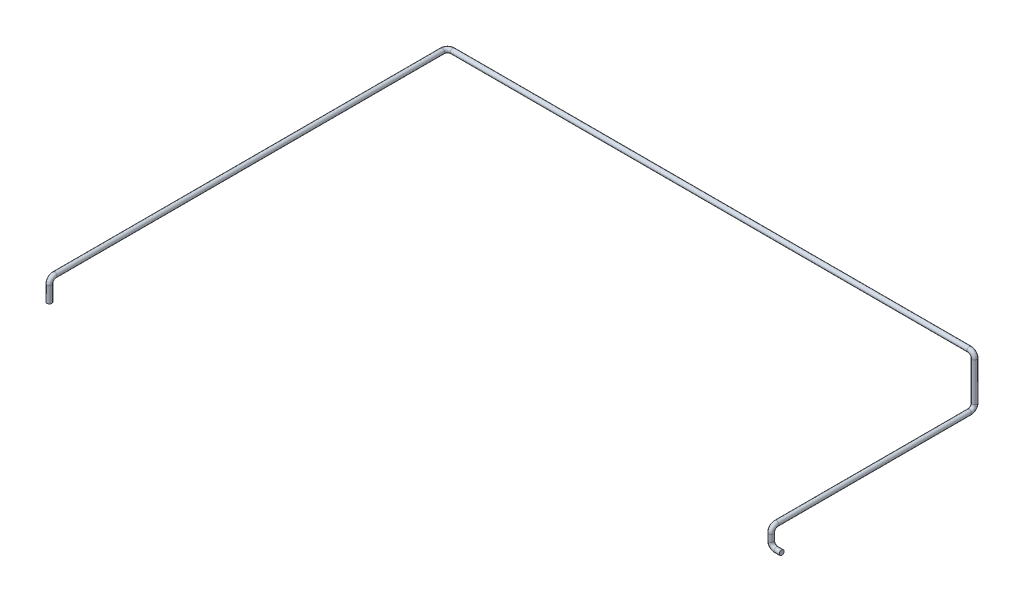
ISO-10303-21;
HEADER;
FILE_DESCRIPTION(('STEP AP214'),'2;1');
FILE_NAME('part.step','',(''),(''),'','','');
FILE_SCHEMA(('AUTOMOTIVE_DESIGN { 1 0 10303 214 1 1 1 1 }'));
ENDSEC;
DATA;
#1=APPLICATION_CONTEXT('core data for automotive mechanical design processes');
#2=APPLICATION_PROTOCOL_DEFINITION('international standard','automotive_design',2000,#1);
#3=PRODUCT_CONTEXT('',#1,'mechanical');
#4=PRODUCT('Part','Part','',(#3));
#5=PRODUCT_RELATED_PRODUCT_CATEGORY('part','',(#4));
#6=PRODUCT_DEFINITION_FORMATION('','',#4);
#7=PRODUCT_DEFINITION_CONTEXT('part definition',#1,'design');
#8=PRODUCT_DEFINITION('design','',#6,#7);
#9=PRODUCT_DEFINITION_SHAPE('','',#8);
#10=(LENGTH_UNIT() NAMED_UNIT(*) SI_UNIT(.MILLI.,.METRE.));
#11=(NAMED_UNIT(*) PLANE_ANGLE_UNIT() SI_UNIT($,.RADIAN.));
#12=(NAMED_UNIT(*) SI_UNIT($,.STERADIAN.) SOLID_ANGLE_UNIT());
#13=UNCERTAINTY_MEASURE_WITH_UNIT(LENGTH_MEASURE(1.E-05),#10,'distance_accuracy_value','');
#14=(GEOMETRIC_REPRESENTATION_CONTEXT(3) GLOBAL_UNCERTAINTY_ASSIGNED_CONTEXT((#13)) GLOBAL_UNIT_ASSIGNED_CONTEXT((#10,
#11,#12)) REPRESENTATION_CONTEXT('',''));
#15=CARTESIAN_POINT('',(0.,0.,0.));
#16=DIRECTION('',(0.,0.,1.));
#17=DIRECTION('',(1.,0.,0.));
#18=AXIS2_PLACEMENT_3D('',#15,#16,#17);
#19=CARTESIAN_POINT('',(0.,0.,0.));
#20=DIRECTION('',(1.,0.,0.));
#21=DIRECTION('',(0.,0.,-1.));
#22=AXIS2_PLACEMENT_3D('',#19,#20,#21);
#23=PLANE('',#22);
#24=CARTESIAN_POINT('',(0.,0.,0.));
#25=DIRECTION('',(1.,0.,0.));
#26=DIRECTION('',(0.,0.,-1.));
#27=AXIS2_PLACEMENT_3D('',#24,#25,#26);
#28=CIRCLE('',#27,13.7);
#29=CARTESIAN_POINT('',(0.,0.,-13.7));
#30=VERTEX_POINT('',#29);
#31=EDGE_CURVE('E47',#30,#30,#28,.T.);
#32=ORIENTED_EDGE('',*,*,#31,.T.);
#33=EDGE_LOOP('',(#32));
#34=FACE_BOUND('',#33,.T.);
#35=ADVANCED_FACE('F35',(#34),#23,.T.);
#36=CARTESIAN_POINT('',(-3065.,260.,1110.));
#37=DIRECTION('',(0.,1.,0.));
#38=DIRECTION('',(-1.,0.,0.));
#39=AXIS2_PLACEMENT_3D('',#36,#37,#38);
#40=PLANE('',#39);
#41=CARTESIAN_POINT('',(-3065.,260.,1110.));
#42=DIRECTION('',(0.,1.,0.));
#43=DIRECTION('',(-1.,0.,0.));
#44=AXIS2_PLACEMENT_3D('',#41,#42,#43);
#45=CIRCLE('',#44,13.7);
#46=CARTESIAN_POINT('',(-3078.7,260.,1110.));
#47=VERTEX_POINT('',#46);
#48=EDGE_CURVE('E11',#47,#47,#45,.T.);
#49=ORIENTED_EDGE('',*,*,#48,.F.);
#50=EDGE_LOOP('',(#49));
#51=FACE_BOUND('',#50,.T.);
#52=ADVANCED_FACE('F53',(#51),#40,.F.);
#53=CARTESIAN_POINT('',(0.,0.,0.));
#54=DIRECTION('',(-1.,0.,0.));
#55=DIRECTION('',(0.,0.,1.));
#56=AXIS2_PLACEMENT_3D('',#53,#54,#55);
#57=CYLINDRICAL_SURFACE('',#56,13.7);
#58=CARTESIAN_POINT('',(-30.,0.,0.));
#59=DIRECTION('',(1.,0.,0.));
#60=DIRECTION('',(0.,0.,-1.));
#61=AXIS2_PLACEMENT_3D('',#58,#59,#60);
#62=CIRCLE('',#61,13.7);
#63=CARTESIAN_POINT('',(-30.,-13.7,0.));
#64=VERTEX_POINT('',#63);
#65=EDGE_CURVE('E119',#64,#64,#62,.T.);
#66=ORIENTED_EDGE('',*,*,#65,.T.);
#67=EDGE_LOOP('',(#66));
#68=FACE_BOUND('',#67,.T.);
#69=ORIENTED_EDGE('',*,*,#31,.F.);
#70=EDGE_LOOP('',(#69));
#71=FACE_BOUND('',#70,.T.);
#72=ADVANCED_FACE('F55',(#68,#71),#57,.T.);
#73=CARTESIAN_POINT('',(-30.,30.,0.));
#74=DIRECTION('',(0.,0.,-1.));
#75=DIRECTION('',(-1.,0.,0.));
#76=AXIS2_PLACEMENT_3D('',#73,#74,#75);
#77=TOROIDAL_SURFACE('',#76,30.,13.7);
#78=CARTESIAN_POINT('',(-60.,30.,0.));
#79=DIRECTION('',(0.,-1.,0.));
#80=DIRECTION('',(0.,0.,-1.));
#81=AXIS2_PLACEMENT_3D('',#78,#79,#80);
#82=CIRCLE('',#81,13.7);
#83=CARTESIAN_POINT('',(-73.7,30.,0.));
#84=VERTEX_POINT('',#83);
#85=EDGE_CURVE('E116',#84,#84,#82,.T.);
#86=CARTESIAN_POINT('',(-30.,30.,0.));
#87=DIRECTION('',(0.,0.,-1.));
#88=DIRECTION('',(-1.,0.,0.));
#89=AXIS2_PLACEMENT_3D('',#86,#87,#88);
#90=CIRCLE('',#89,43.7);
#91=EDGE_CURVE('',#64,#84,#90,.T.);
#92=ORIENTED_EDGE('',*,*,#65,.F.);
#93=ORIENTED_EDGE('',*,*,#85,.T.);
#94=ORIENTED_EDGE('',*,*,#91,.T.);
#95=ORIENTED_EDGE('',*,*,#91,.F.);
#96=EDGE_LOOP('',(#92,#94,#93,#95));
#97=FACE_BOUND('',#96,.T.);
#98=ADVANCED_FACE('F60',(#97),#77,.T.);
#99=CARTESIAN_POINT('',(-60.,30.,0.));
#100=DIRECTION('',(0.,1.,0.));
#101=DIRECTION('',(0.,0.,1.));
#102=AXIS2_PLACEMENT_3D('',#99,#100,#101);
#103=CYLINDRICAL_SURFACE('',#102,13.7);
#104=CARTESIAN_POINT('',(-60.,70.,0.));
#105=DIRECTION('',(0.,-1.,0.));
#106=DIRECTION('',(0.,0.,-1.));
#107=AXIS2_PLACEMENT_3D('',#104,#105,#106);
#108=CIRCLE('',#107,13.7);
#109=CARTESIAN_POINT('',(-60.,70.,13.7));
#110=VERTEX_POINT('',#109);
#111=EDGE_CURVE('E121',#110,#110,#108,.T.);
#112=ORIENTED_EDGE('',*,*,#111,.T.);
#113=EDGE_LOOP('',(#112));
#114=FACE_BOUND('',#113,.T.);
#115=ORIENTED_EDGE('',*,*,#85,.F.);
#116=EDGE_LOOP('',(#115));
#117=FACE_BOUND('',#116,.T.);
#118=ADVANCED_FACE('F104',(#114,#117),#103,.T.);
#119=CARTESIAN_POINT('',(-60.,70.,-30.));
#120=DIRECTION('',(-1.,0.,0.));
#121=DIRECTION('',(0.,0.,1.));
#122=AXIS2_PLACEMENT_3D('',#119,#120,#121);
#123=TOROIDAL_SURFACE('',#122,30.,13.7);
#124=CARTESIAN_POINT('',(-60.,100.,-30.));
#125=DIRECTION('',(0.,0.,1.));
#126=DIRECTION('',(0.,-1.,0.));
#127=AXIS2_PLACEMENT_3D('',#124,#125,#126);
#128=CIRCLE('',#127,13.7);
#129=CARTESIAN_POINT('',(-60.,113.7,-30.));
#130=VERTEX_POINT('',#129);
#131=EDGE_CURVE('E127',#130,#130,#128,.T.);
#132=CARTESIAN_POINT('',(-60.,70.,-30.));
#133=DIRECTION('',(-1.,0.,0.));
#134=DIRECTION('',(0.,0.,1.));
#135=AXIS2_PLACEMENT_3D('',#132,#133,#134);
#136=CIRCLE('',#135,43.7);
#137=EDGE_CURVE('',#110,#130,#136,.T.);
#138=ORIENTED_EDGE('',*,*,#111,.F.);
#139=ORIENTED_EDGE('',*,*,#131,.T.);
#140=ORIENTED_EDGE('',*,*,#137,.T.);
#141=ORIENTED_EDGE('',*,*,#137,.F.);
#142=EDGE_LOOP('',(#138,#140,#139,#141));
#143=FACE_BOUND('',#142,.T.);
#144=ADVANCED_FACE('F100',(#143),#123,.T.);
#145=CARTESIAN_POINT('',(-60.,100.,-30.));
#146=DIRECTION('',(0.,0.,-1.));
#147=DIRECTION('',(-1.,0.,0.));
#148=AXIS2_PLACEMENT_3D('',#145,#146,#147);
#149=CYLINDRICAL_SURFACE('',#148,13.7);
#150=CARTESIAN_POINT('',(-60.0000000000001,100.,-1130.));
#151=DIRECTION('',(0.,0.,1.));
#152=DIRECTION('',(0.,-1.,0.));
#153=AXIS2_PLACEMENT_3D('',#150,#151,#152);
#154=CIRCLE('',#153,13.7);
#155=CARTESIAN_POINT('',(-60.0000000000001,86.3,-1130.));
#156=VERTEX_POINT('',#155);
#157=EDGE_CURVE('E130',#156,#156,#154,.T.);
#158=ORIENTED_EDGE('',*,*,#157,.T.);
#159=EDGE_LOOP('',(#158));
#160=FACE_BOUND('',#159,.T.);
#161=ORIENTED_EDGE('',*,*,#131,.F.);
#162=EDGE_LOOP('',(#161));
#163=FACE_BOUND('',#162,.T.);
#164=ADVANCED_FACE('F96',(#160,#163),#149,.T.);
#165=CARTESIAN_POINT('',(-60.,130.,-1130.));
#166=DIRECTION('',(1.,0.,0.));
#167=DIRECTION('',(0.,0.,-1.));
#168=AXIS2_PLACEMENT_3D('',#165,#166,#167);
#169=TOROIDAL_SURFACE('',#168,30.,13.7);
#170=CARTESIAN_POINT('',(-60.,130.,-1160.));
#171=DIRECTION('',(0.,-1.,0.));
#172=DIRECTION('',(0.,0.,-1.));
#173=AXIS2_PLACEMENT_3D('',#170,#171,#172);
#174=CIRCLE('',#173,13.7);
#175=CARTESIAN_POINT('',(-60.,130.,-1173.7));
#176=VERTEX_POINT('',#175);
#177=EDGE_CURVE('E133',#176,#176,#174,.T.);
#178=CARTESIAN_POINT('',(-60.,130.,-1130.));
#179=DIRECTION('',(1.,0.,0.));
#180=DIRECTION('',(0.,0.,-1.));
#181=AXIS2_PLACEMENT_3D('',#178,#179,#180);
#182=CIRCLE('',#181,43.7);
#183=EDGE_CURVE('',#156,#176,#182,.T.);
#184=ORIENTED_EDGE('',*,*,#157,.F.);
#185=ORIENTED_EDGE('',*,*,#177,.T.);
#186=ORIENTED_EDGE('',*,*,#183,.T.);
#187=ORIENTED_EDGE('',*,*,#183,.F.);
#188=EDGE_LOOP('',(#184,#186,#185,#187));
#189=FACE_BOUND('',#188,.T.);
#190=ADVANCED_FACE('F92',(#189),#169,.T.);
#191=CARTESIAN_POINT('',(-60.0000000000001,130.,-1160.));
#192=DIRECTION('',(0.,1.,0.));
#193=DIRECTION('',(-1.,0.,0.));
#194=AXIS2_PLACEMENT_3D('',#191,#192,#193);
#195=CYLINDRICAL_SURFACE('',#194,13.7);
#196=CARTESIAN_POINT('',(-60.0000000000001,350.,-1160.));
#197=DIRECTION('',(0.,-1.,0.));
#198=DIRECTION('',(0.,0.,-1.));
#199=AXIS2_PLACEMENT_3D('',#196,#197,#198);
#200=CIRCLE('',#199,13.7);
#201=CARTESIAN_POINT('',(-46.3,350.,-1160.));
#202=VERTEX_POINT('',#201);
#203=EDGE_CURVE('E136',#202,#202,#200,.T.);
#204=ORIENTED_EDGE('',*,*,#203,.T.);
#205=EDGE_LOOP('',(#204));
#206=FACE_BOUND('',#205,.T.);
#207=ORIENTED_EDGE('',*,*,#177,.F.);
#208=EDGE_LOOP('',(#207));
#209=FACE_BOUND('',#208,.T.);
#210=ADVANCED_FACE('F88',(#206,#209),#195,.T.);
#211=CARTESIAN_POINT('',(-90.0000000000001,350.,-1160.));
#212=DIRECTION('',(0.,0.,1.));
#213=DIRECTION('',(1.,0.,0.));
#214=AXIS2_PLACEMENT_3D('',#211,#212,#213);
#215=TOROIDAL_SURFACE('',#214,30.,13.7);
#216=CARTESIAN_POINT('',(-90.0000000000001,380.,-1160.));
#217=DIRECTION('',(1.,0.,0.));
#218=DIRECTION('',(0.,0.,-1.));
#219=AXIS2_PLACEMENT_3D('',#216,#217,#218);
#220=CIRCLE('',#219,13.7);
#221=CARTESIAN_POINT('',(-90.0000000000001,393.7,-1160.));
#222=VERTEX_POINT('',#221);
#223=EDGE_CURVE('E139',#222,#222,#220,.T.);
#224=CARTESIAN_POINT('',(-90.0000000000001,350.,-1160.));
#225=DIRECTION('',(0.,0.,1.));
#226=DIRECTION('',(1.,0.,0.));
#227=AXIS2_PLACEMENT_3D('',#224,#225,#226);
#228=CIRCLE('',#227,43.7);
#229=EDGE_CURVE('',#202,#222,#228,.T.);
#230=ORIENTED_EDGE('',*,*,#203,.F.);
#231=ORIENTED_EDGE('',*,*,#223,.T.);
#232=ORIENTED_EDGE('',*,*,#229,.T.);
#233=ORIENTED_EDGE('',*,*,#229,.F.);
#234=EDGE_LOOP('',(#230,#232,#231,#233));
#235=FACE_BOUND('',#234,.T.);
#236=ADVANCED_FACE('F84',(#235),#215,.T.);
#237=CARTESIAN_POINT('',(-90.0000000000001,380.,-1160.));
#238=DIRECTION('',(-1.,0.,0.));
#239=DIRECTION('',(0.,0.,1.));
#240=AXIS2_PLACEMENT_3D('',#237,#238,#239);
#241=CYLINDRICAL_SURFACE('',#240,13.7);
#242=CARTESIAN_POINT('',(-3035.,380.,-1160.));
#243=DIRECTION('',(1.,0.,0.));
#244=DIRECTION('',(0.,0.,-1.));
#245=AXIS2_PLACEMENT_3D('',#242,#243,#244);
#246=CIRCLE('',#245,13.7);
#247=CARTESIAN_POINT('',(-3035.,380.,-1173.7));
#248=VERTEX_POINT('',#247);
#249=EDGE_CURVE('E142',#248,#248,#246,.T.);
#250=ORIENTED_EDGE('',*,*,#249,.T.);
#251=EDGE_LOOP('',(#250));
#252=FACE_BOUND('',#251,.T.);
#253=ORIENTED_EDGE('',*,*,#223,.F.);
#254=EDGE_LOOP('',(#253));
#255=FACE_BOUND('',#254,.T.);
#256=ADVANCED_FACE('F80',(#252,#255),#241,.T.);
#257=CARTESIAN_POINT('',(-3035.,380.,-1130.));
#258=DIRECTION('',(0.,1.,0.));
#259=DIRECTION('',(0.,0.,1.));
#260=AXIS2_PLACEMENT_3D('',#257,#258,#259);
#261=TOROIDAL_SURFACE('',#260,29.9999999999998,13.7);
#262=CARTESIAN_POINT('',(-3065.,380.,-1130.));
#263=DIRECTION('',(0.,0.,-1.));
#264=DIRECTION('',(-1.,0.,0.));
#265=AXIS2_PLACEMENT_3D('',#262,#263,#264);
#266=CIRCLE('',#265,13.7);
#267=CARTESIAN_POINT('',(-3078.7,380.,-1130.));
#268=VERTEX_POINT('',#267);
#269=EDGE_CURVE('E145',#268,#268,#266,.T.);
#270=CARTESIAN_POINT('',(-3035.,380.,-1130.));
#271=DIRECTION('',(0.,1.,0.));
#272=DIRECTION('',(0.,0.,1.));
#273=AXIS2_PLACEMENT_3D('',#270,#271,#272);
#274=CIRCLE('',#273,43.6999999999998);
#275=EDGE_CURVE('',#248,#268,#274,.T.);
#276=ORIENTED_EDGE('',*,*,#249,.F.);
#277=ORIENTED_EDGE('',*,*,#269,.T.);
#278=ORIENTED_EDGE('',*,*,#275,.T.);
#279=ORIENTED_EDGE('',*,*,#275,.F.);
#280=EDGE_LOOP('',(#276,#278,#277,#279));
#281=FACE_BOUND('',#280,.T.);
#282=ADVANCED_FACE('F76',(#281),#261,.T.);
#283=CARTESIAN_POINT('',(-3065.,380.,-1130.));
#284=DIRECTION('',(0.,0.,1.));
#285=DIRECTION('',(1.,0.,0.));
#286=AXIS2_PLACEMENT_3D('',#283,#284,#285);
#287=CYLINDRICAL_SURFACE('',#286,13.7);
#288=CARTESIAN_POINT('',(-3065.,380.,1080.));
#289=DIRECTION('',(0.,0.,-1.));
#290=DIRECTION('',(-1.,0.,0.));
#291=AXIS2_PLACEMENT_3D('',#288,#289,#290);
#292=CIRCLE('',#291,13.7);
#293=CARTESIAN_POINT('',(-3065.,393.7,1080.));
#294=VERTEX_POINT('',#293);
#295=EDGE_CURVE('E148',#294,#294,#292,.T.);
#296=ORIENTED_EDGE('',*,*,#295,.T.);
#297=EDGE_LOOP('',(#296));
#298=FACE_BOUND('',#297,.T.);
#299=ORIENTED_EDGE('',*,*,#269,.F.);
#300=EDGE_LOOP('',(#299));
#301=FACE_BOUND('',#300,.T.);
#302=ADVANCED_FACE('F70',(#298,#301),#287,.T.);
#303=CARTESIAN_POINT('',(-3065.,350.,1080.));
#304=DIRECTION('',(1.,0.,0.));
#305=DIRECTION('',(0.,0.,-1.));
#306=AXIS2_PLACEMENT_3D('',#303,#304,#305);
#307=TOROIDAL_SURFACE('',#306,30.,13.7);
#308=CARTESIAN_POINT('',(-3065.,350.,1110.));
#309=DIRECTION('',(0.,1.,0.));
#310=DIRECTION('',(-1.,0.,0.));
#311=AXIS2_PLACEMENT_3D('',#308,#309,#310);
#312=CIRCLE('',#311,13.7);
#313=CARTESIAN_POINT('',(-3065.,350.,1123.7));
#314=VERTEX_POINT('',#313);
#315=EDGE_CURVE('E42',#314,#314,#312,.T.);
#316=CARTESIAN_POINT('',(-3065.,350.,1080.));
#317=DIRECTION('',(1.,0.,0.));
#318=DIRECTION('',(0.,0.,-1.));
#319=AXIS2_PLACEMENT_3D('',#316,#317,#318);
#320=CIRCLE('',#319,43.7);
#321=EDGE_CURVE('',#294,#314,#320,.T.);
#322=ORIENTED_EDGE('',*,*,#295,.F.);
#323=ORIENTED_EDGE('',*,*,#315,.T.);
#324=ORIENTED_EDGE('',*,*,#321,.T.);
#325=ORIENTED_EDGE('',*,*,#321,.F.);
#326=EDGE_LOOP('',(#322,#324,#323,#325));
#327=FACE_BOUND('',#326,.T.);
#328=ADVANCED_FACE('F66',(#327),#307,.T.);
#329=CARTESIAN_POINT('',(-3065.,350.,1110.));
#330=DIRECTION('',(0.,-1.,0.));
#331=DIRECTION('',(0.,0.,-1.));
#332=AXIS2_PLACEMENT_3D('',#329,#330,#331);
#333=CYLINDRICAL_SURFACE('',#332,13.7);
#334=ORIENTED_EDGE('',*,*,#48,.T.);
#335=EDGE_LOOP('',(#334));
#336=FACE_BOUND('',#335,.T.);
#337=ORIENTED_EDGE('',*,*,#315,.F.);
#338=EDGE_LOOP('',(#337));
#339=FACE_BOUND('',#338,.T.);
#340=ADVANCED_FACE('F50',(#336,#339),#333,.T.);
#341=CLOSED_SHELL('',(#35,#52,#72,#98,#118,#144,#164,#190,#210,#236,#256,#282,#302,#328,#340));
#342=MANIFOLD_SOLID_BREP('B2',#341);
#343=ADVANCED_BREP_SHAPE_REPRESENTATION('',(#18,#342),#14);
#344=SHAPE_DEFINITION_REPRESENTATION(#9,#343);
ENDSEC;
END-ISO-10303-21;
